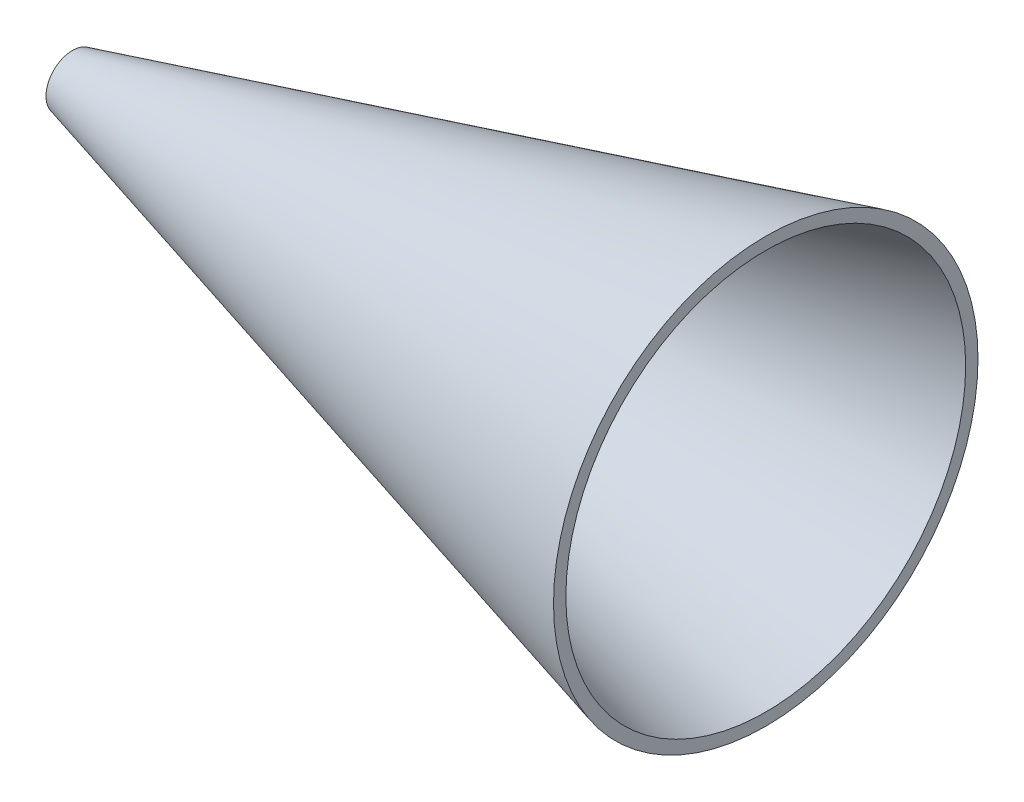
ISO-10303-21;
HEADER;
FILE_DESCRIPTION(('STEP AP214'),'2;1');
FILE_NAME('part.step','',(''),(''),'','','');
FILE_SCHEMA(('AUTOMOTIVE_DESIGN { 1 0 10303 214 1 1 1 1 }'));
ENDSEC;
DATA;
#1=APPLICATION_CONTEXT('core data for automotive mechanical design processes');
#2=APPLICATION_PROTOCOL_DEFINITION('international standard','automotive_design',2000,#1);
#3=PRODUCT_CONTEXT('',#1,'mechanical');
#4=PRODUCT('Part','Part','',(#3));
#5=PRODUCT_RELATED_PRODUCT_CATEGORY('part','',(#4));
#6=PRODUCT_DEFINITION_FORMATION('','',#4);
#7=PRODUCT_DEFINITION_CONTEXT('part definition',#1,'design');
#8=PRODUCT_DEFINITION('design','',#6,#7);
#9=PRODUCT_DEFINITION_SHAPE('','',#8);
#10=(LENGTH_UNIT() NAMED_UNIT(*) SI_UNIT(.MILLI.,.METRE.));
#11=(NAMED_UNIT(*) PLANE_ANGLE_UNIT() SI_UNIT($,.RADIAN.));
#12=(NAMED_UNIT(*) SI_UNIT($,.STERADIAN.) SOLID_ANGLE_UNIT());
#13=UNCERTAINTY_MEASURE_WITH_UNIT(LENGTH_MEASURE(1.E-05),#10,'distance_accuracy_value','');
#14=(GEOMETRIC_REPRESENTATION_CONTEXT(3) GLOBAL_UNCERTAINTY_ASSIGNED_CONTEXT((#13)) GLOBAL_UNIT_ASSIGNED_CONTEXT((#10,
#11,#12)) REPRESENTATION_CONTEXT('',''));
#15=CARTESIAN_POINT('',(0.,0.,0.));
#16=DIRECTION('',(0.,0.,1.));
#17=DIRECTION('',(1.,0.,0.));
#18=AXIS2_PLACEMENT_3D('',#15,#16,#17);
#19=CARTESIAN_POINT('',(-13.8349722300428,5.9,0.));
#20=DIRECTION('',(1.,0.,0.));
#21=DIRECTION('',(0.,0.,-1.));
#22=AXIS2_PLACEMENT_3D('',#19,#20,#21);
#23=PLANE('',#22);
#24=CARTESIAN_POINT('',(-13.8349722300427,0.,0.));
#25=DIRECTION('',(-1.,0.,0.));
#26=DIRECTION('',(0.,0.,1.));
#27=AXIS2_PLACEMENT_3D('',#24,#25,#26);
#28=CIRCLE('',#27,5.9);
#29=CARTESIAN_POINT('',(-13.8349722300427,0.,5.9));
#30=VERTEX_POINT('',#29);
#31=EDGE_CURVE('E50',#30,#30,#28,.T.);
#32=ORIENTED_EDGE('',*,*,#31,.F.);
#33=EDGE_LOOP('',(#32));
#34=FACE_BOUND('',#33,.T.);
#35=CARTESIAN_POINT('',(-13.8349722300427,0.,0.));
#36=DIRECTION('',(-1.,0.,0.));
#37=DIRECTION('',(0.,0.,1.));
#38=AXIS2_PLACEMENT_3D('',#35,#36,#37);
#39=CIRCLE('',#38,11.0765000357222);
#40=CARTESIAN_POINT('',(-13.8349722300427,0.,11.0765000357222));
#41=VERTEX_POINT('',#40);
#42=EDGE_CURVE('E10',#41,#41,#39,.T.);
#43=ORIENTED_EDGE('',*,*,#42,.T.);
#44=EDGE_LOOP('',(#43));
#45=FACE_BOUND('',#44,.T.);
#46=ADVANCED_FACE('F36',(#34,#45),#23,.F.);
#47=CARTESIAN_POINT('',(277.165027769957,0.,0.));
#48=DIRECTION('',(1.,0.,0.));
#49=DIRECTION('',(0.,0.,-1.));
#50=AXIS2_PLACEMENT_3D('',#47,#48,#49);
#51=CONICAL_SURFACE('',#50,89.0765000357222,0.261885264680519);
#52=ORIENTED_EDGE('',*,*,#42,.F.);
#53=EDGE_LOOP('',(#52));
#54=FACE_BOUND('',#53,.T.);
#55=CARTESIAN_POINT('',(277.165027769957,0.,0.));
#56=DIRECTION('',(-1.,0.,0.));
#57=DIRECTION('',(0.,0.,1.));
#58=AXIS2_PLACEMENT_3D('',#55,#56,#57);
#59=CIRCLE('',#58,89.0765000357222);
#60=CARTESIAN_POINT('',(277.165027769957,0.,89.0765000357222));
#61=VERTEX_POINT('',#60);
#62=EDGE_CURVE('E42',#61,#61,#59,.T.);
#63=ORIENTED_EDGE('',*,*,#62,.T.);
#64=EDGE_LOOP('',(#63));
#65=FACE_BOUND('',#64,.T.);
#66=ADVANCED_FACE('F59',(#54,#65),#51,.T.);
#67=CARTESIAN_POINT('',(277.165027769957,89.0765000357222,0.));
#68=DIRECTION('',(-1.,0.,0.));
#69=DIRECTION('',(0.,0.,1.));
#70=AXIS2_PLACEMENT_3D('',#67,#68,#69);
#71=PLANE('',#70);
#72=ORIENTED_EDGE('',*,*,#62,.F.);
#73=EDGE_LOOP('',(#72));
#74=FACE_BOUND('',#73,.T.);
#75=CARTESIAN_POINT('',(277.165027769957,0.,0.));
#76=DIRECTION('',(-1.,0.,0.));
#77=DIRECTION('',(0.,0.,1.));
#78=AXIS2_PLACEMENT_3D('',#75,#76,#77);
#79=CIRCLE('',#78,83.9);
#80=CARTESIAN_POINT('',(277.165027769957,0.,83.9));
#81=VERTEX_POINT('',#80);
#82=EDGE_CURVE('E46',#81,#81,#79,.T.);
#83=ORIENTED_EDGE('',*,*,#82,.T.);
#84=EDGE_LOOP('',(#83));
#85=FACE_BOUND('',#84,.T.);
#86=ADVANCED_FACE('F63',(#74,#85),#71,.F.);
#87=CARTESIAN_POINT('',(-13.8349722300427,0.,0.));
#88=DIRECTION('',(1.,0.,0.));
#89=DIRECTION('',(0.,0.,-1.));
#90=AXIS2_PLACEMENT_3D('',#87,#88,#89);
#91=CONICAL_SURFACE('',#90,5.9,0.261885264680519);
#92=ORIENTED_EDGE('',*,*,#82,.F.);
#93=EDGE_LOOP('',(#92));
#94=FACE_BOUND('',#93,.T.);
#95=ORIENTED_EDGE('',*,*,#31,.T.);
#96=EDGE_LOOP('',(#95));
#97=FACE_BOUND('',#96,.T.);
#98=ADVANCED_FACE('F56',(#94,#97),#91,.F.);
#99=CLOSED_SHELL('',(#46,#66,#86,#98));
#100=MANIFOLD_SOLID_BREP('B2',#99);
#101=ADVANCED_BREP_SHAPE_REPRESENTATION('',(#18,#100),#14);
#102=SHAPE_DEFINITION_REPRESENTATION(#9,#101);
ENDSEC;
END-ISO-10303-21;
